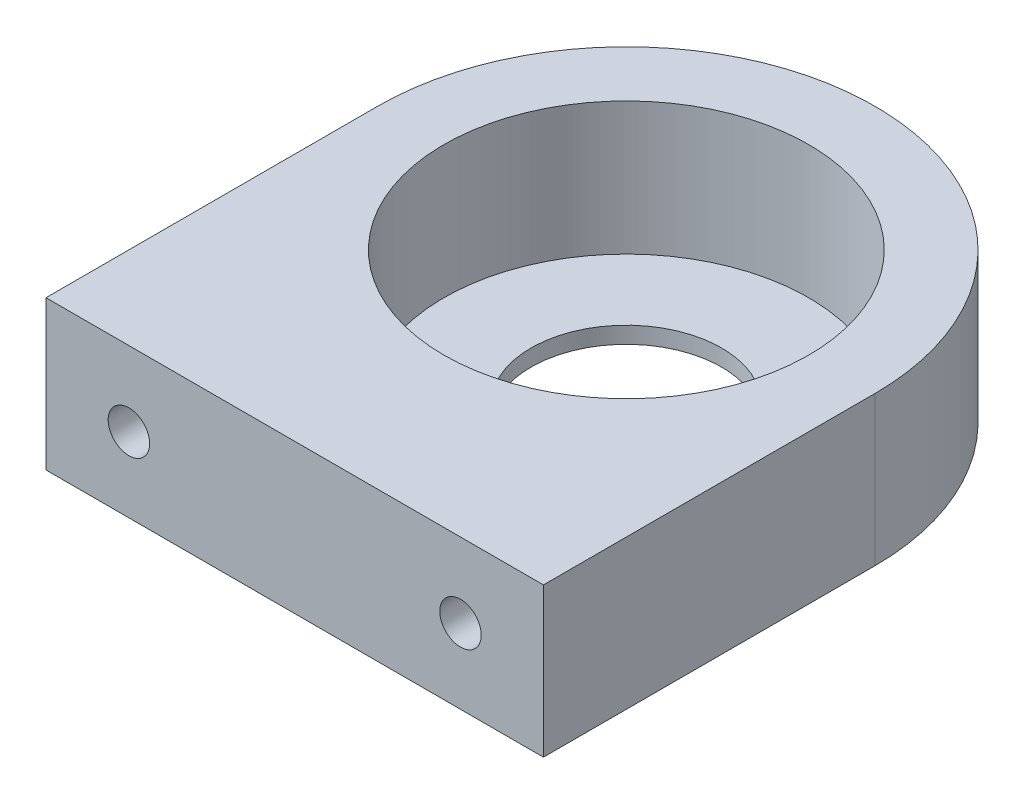
ISO-10303-21;
HEADER;
FILE_DESCRIPTION(('STEP AP214'),'2;1');
FILE_NAME('part.step','',(''),(''),'','','');
FILE_SCHEMA(('AUTOMOTIVE_DESIGN { 1 0 10303 214 1 1 1 1 }'));
ENDSEC;
DATA;
#1=APPLICATION_CONTEXT('core data for automotive mechanical design processes');
#2=APPLICATION_PROTOCOL_DEFINITION('international standard','automotive_design',2000,#1);
#3=PRODUCT_CONTEXT('',#1,'mechanical');
#4=PRODUCT('Part','Part','',(#3));
#5=PRODUCT_RELATED_PRODUCT_CATEGORY('part','',(#4));
#6=PRODUCT_DEFINITION_FORMATION('','',#4);
#7=PRODUCT_DEFINITION_CONTEXT('part definition',#1,'design');
#8=PRODUCT_DEFINITION('design','',#6,#7);
#9=PRODUCT_DEFINITION_SHAPE('','',#8);
#10=(LENGTH_UNIT() NAMED_UNIT(*) SI_UNIT(.MILLI.,.METRE.));
#11=(NAMED_UNIT(*) PLANE_ANGLE_UNIT() SI_UNIT($,.RADIAN.));
#12=(NAMED_UNIT(*) SI_UNIT($,.STERADIAN.) SOLID_ANGLE_UNIT());
#13=UNCERTAINTY_MEASURE_WITH_UNIT(LENGTH_MEASURE(1.E-05),#10,'distance_accuracy_value','');
#14=(GEOMETRIC_REPRESENTATION_CONTEXT(3) GLOBAL_UNCERTAINTY_ASSIGNED_CONTEXT((#13)) GLOBAL_UNIT_ASSIGNED_CONTEXT((#10,
#11,#12)) REPRESENTATION_CONTEXT('',''));
#15=CARTESIAN_POINT('',(0.,0.,0.));
#16=DIRECTION('',(0.,0.,1.));
#17=DIRECTION('',(1.,0.,0.));
#18=AXIS2_PLACEMENT_3D('',#15,#16,#17);
#19=CARTESIAN_POINT('',(15.,9.,-20.));
#20=DIRECTION('',(0.,-1.,0.));
#21=DIRECTION('',(0.,0.,-1.));
#22=AXIS2_PLACEMENT_3D('',#19,#20,#21);
#23=CYLINDRICAL_SURFACE('',#22,5.75);
#24=CARTESIAN_POINT('',(15.,0.,-20.));
#25=DIRECTION('',(0.,1.,0.));
#26=DIRECTION('',(0.,0.,1.));
#27=AXIS2_PLACEMENT_3D('',#24,#25,#26);
#28=CIRCLE('',#27,5.75);
#29=CARTESIAN_POINT('',(15.,0.,-14.25));
#30=VERTEX_POINT('',#29);
#31=EDGE_CURVE('E129',#30,#30,#28,.T.);
#32=ORIENTED_EDGE('',*,*,#31,.F.);
#33=EDGE_LOOP('',(#32));
#34=FACE_BOUND('',#33,.T.);
#35=CARTESIAN_POINT('',(15.,1.,-20.));
#36=DIRECTION('',(0.,1.,0.));
#37=DIRECTION('',(0.,0.,1.));
#38=AXIS2_PLACEMENT_3D('',#35,#36,#37);
#39=CIRCLE('',#38,5.75);
#40=CARTESIAN_POINT('',(15.,1.,-14.25));
#41=VERTEX_POINT('',#40);
#42=EDGE_CURVE('E50',#41,#41,#39,.T.);
#43=ORIENTED_EDGE('',*,*,#42,.T.);
#44=EDGE_LOOP('',(#43));
#45=FACE_BOUND('',#44,.T.);
#46=ADVANCED_FACE('F46',(#34,#45),#23,.F.);
#47=CARTESIAN_POINT('',(30.,9.,0.));
#48=DIRECTION('',(-1.,0.,0.));
#49=DIRECTION('',(0.,0.,1.));
#50=AXIS2_PLACEMENT_3D('',#47,#48,#49);
#51=PLANE('',#50);
#52=DIRECTION('',(0.,0.,-1.));
#53=VECTOR('',#52,1.);
#54=CARTESIAN_POINT('',(30.,0.,0.));
#55=LINE('',#54,#53);
#56=CARTESIAN_POINT('',(30.,0.,0.));
#57=VERTEX_POINT('',#56);
#58=CARTESIAN_POINT('',(30.,0.,-20.));
#59=VERTEX_POINT('',#58);
#60=EDGE_CURVE('E117',#57,#59,#55,.T.);
#61=ORIENTED_EDGE('',*,*,#60,.T.);
#62=DIRECTION('',(0.,-1.,0.));
#63=VECTOR('',#62,1.);
#64=CARTESIAN_POINT('',(30.,9.,-20.));
#65=LINE('',#64,#63);
#66=CARTESIAN_POINT('',(30.,9.,-20.));
#67=VERTEX_POINT('',#66);
#68=EDGE_CURVE('E11',#67,#59,#65,.T.);
#69=ORIENTED_EDGE('',*,*,#68,.F.);
#70=DIRECTION('',(0.,0.,-1.));
#71=VECTOR('',#70,1.);
#72=CARTESIAN_POINT('',(30.,9.,0.));
#73=LINE('',#72,#71);
#74=CARTESIAN_POINT('',(30.,9.,0.));
#75=VERTEX_POINT('',#74);
#76=EDGE_CURVE('E98',#75,#67,#73,.T.);
#77=ORIENTED_EDGE('',*,*,#76,.F.);
#78=DIRECTION('',(0.,-1.,0.));
#79=VECTOR('',#78,1.);
#80=CARTESIAN_POINT('',(30.,9.,0.));
#81=LINE('',#80,#79);
#82=EDGE_CURVE('E65',#75,#57,#81,.T.);
#83=ORIENTED_EDGE('',*,*,#82,.T.);
#84=EDGE_LOOP('',(#61,#69,#77,#83));
#85=FACE_BOUND('',#84,.T.);
#86=ADVANCED_FACE('F48',(#85),#51,.F.);
#87=CARTESIAN_POINT('',(15.,9.,-20.));
#88=DIRECTION('',(0.,-1.,0.));
#89=DIRECTION('',(0.,0.,-1.));
#90=AXIS2_PLACEMENT_3D('',#87,#88,#89);
#91=CYLINDRICAL_SURFACE('',#90,15.);
#92=CARTESIAN_POINT('',(15.,0.,-20.));
#93=DIRECTION('',(0.,1.,0.));
#94=DIRECTION('',(0.,0.,1.));
#95=AXIS2_PLACEMENT_3D('',#92,#93,#94);
#96=CIRCLE('',#95,15.);
#97=CARTESIAN_POINT('',(0.,0.,-20.));
#98=VERTEX_POINT('',#97);
#99=EDGE_CURVE('E104',#59,#98,#96,.T.);
#100=ORIENTED_EDGE('',*,*,#99,.T.);
#101=DIRECTION('',(0.,-1.,0.));
#102=VECTOR('',#101,1.);
#103=CARTESIAN_POINT('',(0.,9.,-20.));
#104=LINE('',#103,#102);
#105=CARTESIAN_POINT('',(0.,9.,-20.));
#106=VERTEX_POINT('',#105);
#107=EDGE_CURVE('E57',#106,#98,#104,.T.);
#108=ORIENTED_EDGE('',*,*,#107,.F.);
#109=CARTESIAN_POINT('',(15.,9.,-20.));
#110=DIRECTION('',(0.,1.,0.));
#111=DIRECTION('',(0.,0.,1.));
#112=AXIS2_PLACEMENT_3D('',#109,#110,#111);
#113=CIRCLE('',#112,15.);
#114=EDGE_CURVE('E90',#67,#106,#113,.T.);
#115=ORIENTED_EDGE('',*,*,#114,.F.);
#116=ORIENTED_EDGE('',*,*,#68,.T.);
#117=EDGE_LOOP('',(#100,#108,#115,#116));
#118=FACE_BOUND('',#117,.T.);
#119=ADVANCED_FACE('F103',(#118),#91,.T.);
#120=CARTESIAN_POINT('',(0.,9.,0.));
#121=DIRECTION('',(-1.,0.,0.));
#122=DIRECTION('',(0.,0.,1.));
#123=AXIS2_PLACEMENT_3D('',#120,#121,#122);
#124=PLANE('',#123);
#125=DIRECTION('',(0.,0.,-1.));
#126=VECTOR('',#125,1.);
#127=CARTESIAN_POINT('',(0.,0.,0.));
#128=LINE('',#127,#126);
#129=CARTESIAN_POINT('',(0.,0.,0.));
#130=VERTEX_POINT('',#129);
#131=EDGE_CURVE('E122',#130,#98,#128,.T.);
#132=ORIENTED_EDGE('',*,*,#131,.F.);
#133=DIRECTION('',(0.,-1.,0.));
#134=VECTOR('',#133,1.);
#135=CARTESIAN_POINT('',(0.,9.,0.));
#136=LINE('',#135,#134);
#137=CARTESIAN_POINT('',(0.,9.,0.));
#138=VERTEX_POINT('',#137);
#139=EDGE_CURVE('E79',#138,#130,#136,.T.);
#140=ORIENTED_EDGE('',*,*,#139,.F.);
#141=DIRECTION('',(0.,0.,-1.));
#142=VECTOR('',#141,1.);
#143=CARTESIAN_POINT('',(0.,9.,0.));
#144=LINE('',#143,#142);
#145=EDGE_CURVE('E97',#138,#106,#144,.T.);
#146=ORIENTED_EDGE('',*,*,#145,.T.);
#147=ORIENTED_EDGE('',*,*,#107,.T.);
#148=EDGE_LOOP('',(#132,#140,#146,#147));
#149=FACE_BOUND('',#148,.T.);
#150=ADVANCED_FACE('F109',(#149),#124,.T.);
#151=CARTESIAN_POINT('',(0.,9.,0.));
#152=DIRECTION('',(0.,0.,1.));
#153=DIRECTION('',(1.,0.,0.));
#154=AXIS2_PLACEMENT_3D('',#151,#152,#153);
#155=PLANE('',#154);
#156=CARTESIAN_POINT('',(25.,4.5,0.));
#157=DIRECTION('',(0.,0.,1.));
#158=DIRECTION('',(1.,0.,0.));
#159=AXIS2_PLACEMENT_3D('',#156,#157,#158);
#160=CIRCLE('',#159,1.25);
#161=CARTESIAN_POINT('',(26.25,4.5,0.));
#162=VERTEX_POINT('',#161);
#163=EDGE_CURVE('E157',#162,#162,#160,.T.);
#164=ORIENTED_EDGE('',*,*,#163,.F.);
#165=EDGE_LOOP('',(#164));
#166=FACE_BOUND('',#165,.T.);
#167=CARTESIAN_POINT('',(5.,4.5,0.));
#168=DIRECTION('',(0.,0.,1.));
#169=DIRECTION('',(1.,0.,0.));
#170=AXIS2_PLACEMENT_3D('',#167,#168,#169);
#171=CIRCLE('',#170,1.25);
#172=CARTESIAN_POINT('',(6.25,4.5,0.));
#173=VERTEX_POINT('',#172);
#174=EDGE_CURVE('E153',#173,#173,#171,.T.);
#175=ORIENTED_EDGE('',*,*,#174,.F.);
#176=EDGE_LOOP('',(#175));
#177=FACE_BOUND('',#176,.T.);
#178=DIRECTION('',(-1.,0.,0.));
#179=VECTOR('',#178,1.);
#180=CARTESIAN_POINT('',(0.,0.,0.));
#181=LINE('',#180,#179);
#182=EDGE_CURVE('E125',#57,#130,#181,.T.);
#183=ORIENTED_EDGE('',*,*,#182,.F.);
#184=ORIENTED_EDGE('',*,*,#82,.F.);
#185=DIRECTION('',(-1.,0.,0.));
#186=VECTOR('',#185,1.);
#187=CARTESIAN_POINT('',(0.,9.,0.));
#188=LINE('',#187,#186);
#189=EDGE_CURVE('E111',#75,#138,#188,.T.);
#190=ORIENTED_EDGE('',*,*,#189,.T.);
#191=ORIENTED_EDGE('',*,*,#139,.T.);
#192=EDGE_LOOP('',(#183,#184,#190,#191));
#193=FACE_BOUND('',#192,.T.);
#194=ADVANCED_FACE('F174',(#166,#177,#193),#155,.T.);
#195=CARTESIAN_POINT('',(0.,9.,0.));
#196=DIRECTION('',(0.,1.,0.));
#197=DIRECTION('',(0.,0.,1.));
#198=AXIS2_PLACEMENT_3D('',#195,#196,#197);
#199=PLANE('',#198);
#200=CARTESIAN_POINT('',(15.,9.,-20.));
#201=DIRECTION('',(0.,1.,0.));
#202=DIRECTION('',(0.,0.,1.));
#203=AXIS2_PLACEMENT_3D('',#200,#201,#202);
#204=CIRCLE('',#203,11.);
#205=CARTESIAN_POINT('',(15.,9.,-9.));
#206=VERTEX_POINT('',#205);
#207=EDGE_CURVE('E140',#206,#206,#204,.T.);
#208=ORIENTED_EDGE('',*,*,#207,.F.);
#209=EDGE_LOOP('',(#208));
#210=FACE_BOUND('',#209,.T.);
#211=ORIENTED_EDGE('',*,*,#76,.T.);
#212=ORIENTED_EDGE('',*,*,#114,.T.);
#213=ORIENTED_EDGE('',*,*,#145,.F.);
#214=ORIENTED_EDGE('',*,*,#189,.F.);
#215=EDGE_LOOP('',(#211,#212,#213,#214));
#216=FACE_BOUND('',#215,.T.);
#217=ADVANCED_FACE('F94',(#210,#216),#199,.T.);
#218=CARTESIAN_POINT('',(0.,0.,0.));
#219=DIRECTION('',(0.,1.,0.));
#220=DIRECTION('',(0.,0.,1.));
#221=AXIS2_PLACEMENT_3D('',#218,#219,#220);
#222=PLANE('',#221);
#223=ORIENTED_EDGE('',*,*,#60,.F.);
#224=ORIENTED_EDGE('',*,*,#182,.T.);
#225=ORIENTED_EDGE('',*,*,#131,.T.);
#226=ORIENTED_EDGE('',*,*,#99,.F.);
#227=EDGE_LOOP('',(#223,#224,#225,#226));
#228=FACE_BOUND('',#227,.T.);
#229=ORIENTED_EDGE('',*,*,#31,.T.);
#230=EDGE_LOOP('',(#229));
#231=FACE_BOUND('',#230,.T.);
#232=ADVANCED_FACE('F180',(#228,#231),#222,.F.);
#233=CARTESIAN_POINT('',(15.,1.,-20.));
#234=DIRECTION('',(0.,1.,0.));
#235=DIRECTION('',(0.,0.,1.));
#236=AXIS2_PLACEMENT_3D('',#233,#234,#235);
#237=CYLINDRICAL_SURFACE('',#236,11.);
#238=CARTESIAN_POINT('',(15.,1.,-20.));
#239=DIRECTION('',(0.,1.,0.));
#240=DIRECTION('',(0.,0.,1.));
#241=AXIS2_PLACEMENT_3D('',#238,#239,#240);
#242=CIRCLE('',#241,11.);
#243=CARTESIAN_POINT('',(15.,1.,-9.));
#244=VERTEX_POINT('',#243);
#245=EDGE_CURVE('E144',#244,#244,#242,.T.);
#246=ORIENTED_EDGE('',*,*,#245,.F.);
#247=EDGE_LOOP('',(#246));
#248=FACE_BOUND('',#247,.T.);
#249=ORIENTED_EDGE('',*,*,#207,.T.);
#250=EDGE_LOOP('',(#249));
#251=FACE_BOUND('',#250,.T.);
#252=ADVANCED_FACE('F218',(#248,#251),#237,.F.);
#253=CARTESIAN_POINT('',(15.,1.,-20.));
#254=DIRECTION('',(0.,1.,0.));
#255=DIRECTION('',(0.,0.,1.));
#256=AXIS2_PLACEMENT_3D('',#253,#254,#255);
#257=PLANE('',#256);
#258=ORIENTED_EDGE('',*,*,#42,.F.);
#259=EDGE_LOOP('',(#258));
#260=FACE_BOUND('',#259,.T.);
#261=ORIENTED_EDGE('',*,*,#245,.T.);
#262=EDGE_LOOP('',(#261));
#263=FACE_BOUND('',#262,.T.);
#264=ADVANCED_FACE('F223',(#260,#263),#257,.T.);
#265=CARTESIAN_POINT('',(5.,4.5,-10.));
#266=DIRECTION('',(0.,0.,1.));
#267=DIRECTION('',(1.,0.,0.));
#268=AXIS2_PLACEMENT_3D('',#265,#266,#267);
#269=CYLINDRICAL_SURFACE('',#268,1.25);
#270=CARTESIAN_POINT('',(5.,4.5,-10.));
#271=DIRECTION('',(0.,0.,1.));
#272=DIRECTION('',(1.,0.,0.));
#273=AXIS2_PLACEMENT_3D('',#270,#271,#272);
#274=CIRCLE('',#273,1.25);
#275=CARTESIAN_POINT('',(6.25,4.5,-10.));
#276=VERTEX_POINT('',#275);
#277=EDGE_CURVE('E149',#276,#276,#274,.T.);
#278=ORIENTED_EDGE('',*,*,#277,.F.);
#279=EDGE_LOOP('',(#278));
#280=FACE_BOUND('',#279,.T.);
#281=ORIENTED_EDGE('',*,*,#174,.T.);
#282=EDGE_LOOP('',(#281));
#283=FACE_BOUND('',#282,.T.);
#284=ADVANCED_FACE('F230',(#280,#283),#269,.F.);
#285=CARTESIAN_POINT('',(5.,4.5,-10.));
#286=DIRECTION('',(0.,0.,1.));
#287=DIRECTION('',(1.,0.,0.));
#288=AXIS2_PLACEMENT_3D('',#285,#286,#287);
#289=PLANE('',#288);
#290=ORIENTED_EDGE('',*,*,#277,.T.);
#291=EDGE_LOOP('',(#290));
#292=FACE_BOUND('',#291,.T.);
#293=ADVANCED_FACE('F170',(#292),#289,.T.);
#294=CARTESIAN_POINT('',(25.,4.5,-10.));
#295=DIRECTION('',(0.,0.,1.));
#296=DIRECTION('',(1.,0.,0.));
#297=AXIS2_PLACEMENT_3D('',#294,#295,#296);
#298=CYLINDRICAL_SURFACE('',#297,1.25);
#299=CARTESIAN_POINT('',(25.,4.5,-10.));
#300=DIRECTION('',(0.,0.,1.));
#301=DIRECTION('',(1.,0.,0.));
#302=AXIS2_PLACEMENT_3D('',#299,#300,#301);
#303=CIRCLE('',#302,1.25);
#304=CARTESIAN_POINT('',(26.25,4.5,-10.));
#305=VERTEX_POINT('',#304);
#306=EDGE_CURVE('E145',#305,#305,#303,.T.);
#307=ORIENTED_EDGE('',*,*,#306,.F.);
#308=EDGE_LOOP('',(#307));
#309=FACE_BOUND('',#308,.T.);
#310=ORIENTED_EDGE('',*,*,#163,.T.);
#311=EDGE_LOOP('',(#310));
#312=FACE_BOUND('',#311,.T.);
#313=ADVANCED_FACE('F167',(#309,#312),#298,.F.);
#314=CARTESIAN_POINT('',(25.,4.5,-10.));
#315=DIRECTION('',(0.,0.,1.));
#316=DIRECTION('',(1.,0.,0.));
#317=AXIS2_PLACEMENT_3D('',#314,#315,#316);
#318=PLANE('',#317);
#319=ORIENTED_EDGE('',*,*,#306,.T.);
#320=EDGE_LOOP('',(#319));
#321=FACE_BOUND('',#320,.T.);
#322=ADVANCED_FACE('F165',(#321),#318,.T.);
#323=CLOSED_SHELL('',(#46,#86,#119,#150,#194,#217,#232,#252,#264,#284,#293,#313,#322));
#324=MANIFOLD_SOLID_BREP('B2',#323);
#325=ADVANCED_BREP_SHAPE_REPRESENTATION('',(#18,#324),#14);
#326=SHAPE_DEFINITION_REPRESENTATION(#9,#325);
ENDSEC;
END-ISO-10303-21;
